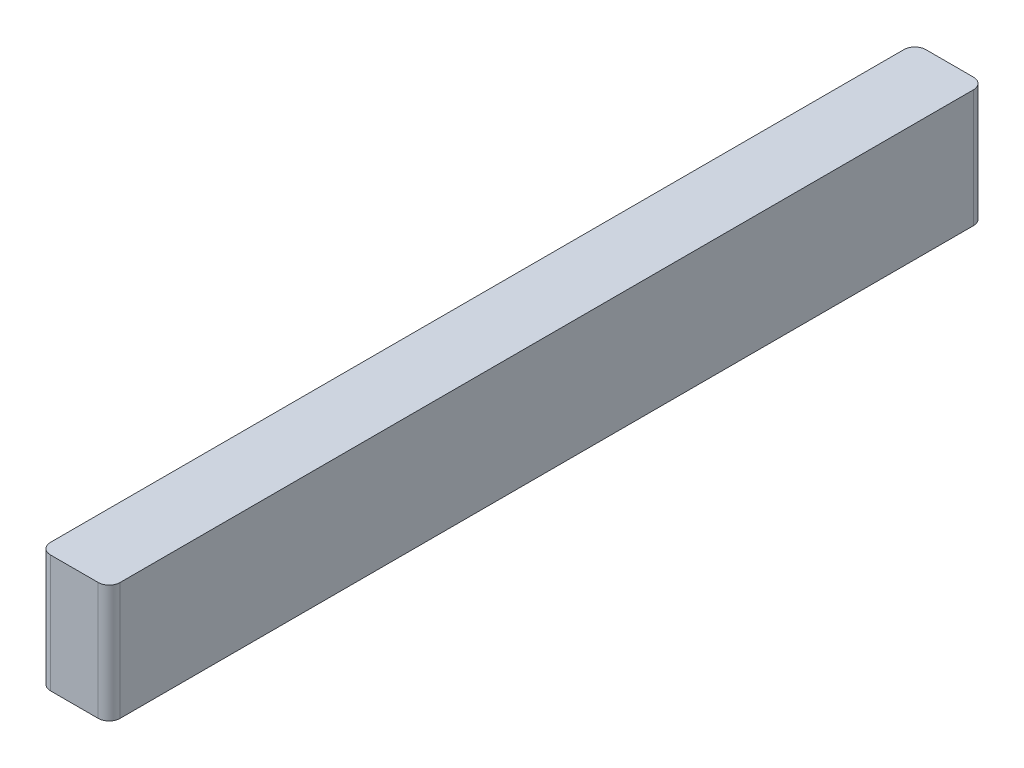
ISO-10303-21;
HEADER;
FILE_DESCRIPTION(('STEP AP214'),'2;1');
FILE_NAME('part.step','',(''),(''),'','','');
FILE_SCHEMA(('AUTOMOTIVE_DESIGN { 1 0 10303 214 1 1 1 1 }'));
ENDSEC;
DATA;
#1=APPLICATION_CONTEXT('core data for automotive mechanical design processes');
#2=APPLICATION_PROTOCOL_DEFINITION('international standard','automotive_design',2000,#1);
#3=PRODUCT_CONTEXT('',#1,'mechanical');
#4=PRODUCT('Part','Part','',(#3));
#5=PRODUCT_RELATED_PRODUCT_CATEGORY('part','',(#4));
#6=PRODUCT_DEFINITION_FORMATION('','',#4);
#7=PRODUCT_DEFINITION_CONTEXT('part definition',#1,'design');
#8=PRODUCT_DEFINITION('design','',#6,#7);
#9=PRODUCT_DEFINITION_SHAPE('','',#8);
#10=(LENGTH_UNIT() NAMED_UNIT(*) SI_UNIT(.MILLI.,.METRE.));
#11=(NAMED_UNIT(*) PLANE_ANGLE_UNIT() SI_UNIT($,.RADIAN.));
#12=(NAMED_UNIT(*) SI_UNIT($,.STERADIAN.) SOLID_ANGLE_UNIT());
#13=UNCERTAINTY_MEASURE_WITH_UNIT(LENGTH_MEASURE(1.E-05),#10,'distance_accuracy_value','');
#14=(GEOMETRIC_REPRESENTATION_CONTEXT(3) GLOBAL_UNCERTAINTY_ASSIGNED_CONTEXT((#13)) GLOBAL_UNIT_ASSIGNED_CONTEXT((#10,
#11,#12)) REPRESENTATION_CONTEXT('',''));
#15=CARTESIAN_POINT('',(0.,0.,0.));
#16=DIRECTION('',(0.,0.,1.));
#17=DIRECTION('',(1.,0.,0.));
#18=AXIS2_PLACEMENT_3D('',#15,#16,#17);
#19=CARTESIAN_POINT('',(34.036,68.326,-6.35));
#20=DIRECTION('',(0.,-1.,0.));
#21=DIRECTION('',(0.,0.,-1.));
#22=AXIS2_PLACEMENT_3D('',#19,#20,#21);
#23=CYLINDRICAL_SURFACE('',#22,6.35);
#24=CARTESIAN_POINT('',(34.036,0.,-6.35));
#25=DIRECTION('',(0.,1.,0.));
#26=DIRECTION('',(0.,0.,1.));
#27=AXIS2_PLACEMENT_3D('',#24,#25,#26);
#28=CIRCLE('',#27,6.35);
#29=CARTESIAN_POINT('',(34.036,0.,0.));
#30=VERTEX_POINT('',#29);
#31=CARTESIAN_POINT('',(40.386,0.,-6.35000000000004));
#32=VERTEX_POINT('',#31);
#33=EDGE_CURVE('E131',#30,#32,#28,.T.);
#34=ORIENTED_EDGE('',*,*,#33,.T.);
#35=DIRECTION('',(0.,-1.,0.));
#36=VECTOR('',#35,1.);
#37=CARTESIAN_POINT('',(40.386,68.326,-6.35000000000004));
#38=LINE('',#37,#36);
#39=CARTESIAN_POINT('',(40.386,68.326,-6.35000000000004));
#40=VERTEX_POINT('',#39);
#41=EDGE_CURVE('E11',#40,#32,#38,.T.);
#42=ORIENTED_EDGE('',*,*,#41,.F.);
#43=CARTESIAN_POINT('',(34.036,68.326,-6.35));
#44=DIRECTION('',(0.,1.,0.));
#45=DIRECTION('',(0.,0.,1.));
#46=AXIS2_PLACEMENT_3D('',#43,#44,#45);
#47=CIRCLE('',#46,6.35);
#48=CARTESIAN_POINT('',(34.036,68.326,0.));
#49=VERTEX_POINT('',#48);
#50=EDGE_CURVE('E145',#49,#40,#47,.T.);
#51=ORIENTED_EDGE('',*,*,#50,.F.);
#52=DIRECTION('',(0.,-1.,0.));
#53=VECTOR('',#52,1.);
#54=CARTESIAN_POINT('',(34.036,68.326,0.));
#55=LINE('',#54,#53);
#56=EDGE_CURVE('E127',#49,#30,#55,.T.);
#57=ORIENTED_EDGE('',*,*,#56,.T.);
#58=EDGE_LOOP('',(#34,#42,#51,#57));
#59=FACE_BOUND('',#58,.T.);
#60=ADVANCED_FACE('F35',(#59),#23,.T.);
#61=CARTESIAN_POINT('',(40.386,68.326,-6.35000000000004));
#62=DIRECTION('',(-1.,0.,0.));
#63=DIRECTION('',(0.,0.,1.));
#64=AXIS2_PLACEMENT_3D('',#61,#62,#63);
#65=PLANE('',#64);
#66=DIRECTION('',(0.,0.,-1.));
#67=VECTOR('',#66,1.);
#68=CARTESIAN_POINT('',(40.386,0.,-6.35000000000004));
#69=LINE('',#68,#67);
#70=CARTESIAN_POINT('',(40.386,0.,-501.65));
#71=VERTEX_POINT('',#70);
#72=EDGE_CURVE('E134',#32,#71,#69,.T.);
#73=ORIENTED_EDGE('',*,*,#72,.T.);
#74=DIRECTION('',(0.,-1.,0.));
#75=VECTOR('',#74,1.);
#76=CARTESIAN_POINT('',(40.386,68.326,-501.65));
#77=LINE('',#76,#75);
#78=CARTESIAN_POINT('',(40.386,68.326,-501.65));
#79=VERTEX_POINT('',#78);
#80=EDGE_CURVE('E43',#79,#71,#77,.T.);
#81=ORIENTED_EDGE('',*,*,#80,.F.);
#82=DIRECTION('',(0.,0.,-1.));
#83=VECTOR('',#82,1.);
#84=CARTESIAN_POINT('',(40.386,68.326,-6.35000000000004));
#85=LINE('',#84,#83);
#86=EDGE_CURVE('E94',#40,#79,#85,.T.);
#87=ORIENTED_EDGE('',*,*,#86,.F.);
#88=ORIENTED_EDGE('',*,*,#41,.T.);
#89=EDGE_LOOP('',(#73,#81,#87,#88));
#90=FACE_BOUND('',#89,.T.);
#91=ADVANCED_FACE('F180',(#90),#65,.F.);
#92=CARTESIAN_POINT('',(34.036,68.326,-501.65));
#93=DIRECTION('',(0.,-1.,0.));
#94=DIRECTION('',(0.,0.,-1.));
#95=AXIS2_PLACEMENT_3D('',#92,#93,#94);
#96=CYLINDRICAL_SURFACE('',#95,6.34999999999998);
#97=CARTESIAN_POINT('',(34.036,0.,-501.65));
#98=DIRECTION('',(0.,1.,0.));
#99=DIRECTION('',(0.,0.,-1.));
#100=AXIS2_PLACEMENT_3D('',#97,#98,#99);
#101=CIRCLE('',#100,6.34999999999998);
#102=CARTESIAN_POINT('',(34.036,0.,-508.));
#103=VERTEX_POINT('',#102);
#104=EDGE_CURVE('E136',#71,#103,#101,.T.);
#105=ORIENTED_EDGE('',*,*,#104,.T.);
#106=DIRECTION('',(0.,-1.,0.));
#107=VECTOR('',#106,1.);
#108=CARTESIAN_POINT('',(34.036,68.326,-508.));
#109=LINE('',#108,#107);
#110=CARTESIAN_POINT('',(34.036,68.326,-508.));
#111=VERTEX_POINT('',#110);
#112=EDGE_CURVE('E152',#111,#103,#109,.T.);
#113=ORIENTED_EDGE('',*,*,#112,.F.);
#114=CARTESIAN_POINT('',(34.036,68.326,-501.65));
#115=DIRECTION('',(0.,1.,0.));
#116=DIRECTION('',(0.,0.,-1.));
#117=AXIS2_PLACEMENT_3D('',#114,#115,#116);
#118=CIRCLE('',#117,6.34999999999998);
#119=EDGE_CURVE('E160',#79,#111,#118,.T.);
#120=ORIENTED_EDGE('',*,*,#119,.F.);
#121=ORIENTED_EDGE('',*,*,#80,.T.);
#122=EDGE_LOOP('',(#105,#113,#120,#121));
#123=FACE_BOUND('',#122,.T.);
#124=ADVANCED_FACE('F158',(#123),#96,.T.);
#125=CARTESIAN_POINT('',(6.35000000000004,68.326,-508.));
#126=DIRECTION('',(0.,0.,1.));
#127=DIRECTION('',(1.,0.,0.));
#128=AXIS2_PLACEMENT_3D('',#125,#126,#127);
#129=PLANE('',#128);
#130=DIRECTION('',(-1.,0.,0.));
#131=VECTOR('',#130,1.);
#132=CARTESIAN_POINT('',(6.35000000000004,0.,-508.));
#133=LINE('',#132,#131);
#134=CARTESIAN_POINT('',(6.35000000000004,0.,-508.));
#135=VERTEX_POINT('',#134);
#136=EDGE_CURVE('E138',#103,#135,#133,.T.);
#137=ORIENTED_EDGE('',*,*,#136,.T.);
#138=DIRECTION('',(0.,-1.,0.));
#139=VECTOR('',#138,1.);
#140=CARTESIAN_POINT('',(6.35000000000004,68.326,-508.));
#141=LINE('',#140,#139);
#142=CARTESIAN_POINT('',(6.35000000000004,68.326,-508.));
#143=VERTEX_POINT('',#142);
#144=EDGE_CURVE('E149',#143,#135,#141,.T.);
#145=ORIENTED_EDGE('',*,*,#144,.F.);
#146=DIRECTION('',(-1.,0.,0.));
#147=VECTOR('',#146,1.);
#148=CARTESIAN_POINT('',(6.35000000000004,68.326,-508.));
#149=LINE('',#148,#147);
#150=EDGE_CURVE('E172',#111,#143,#149,.T.);
#151=ORIENTED_EDGE('',*,*,#150,.F.);
#152=ORIENTED_EDGE('',*,*,#112,.T.);
#153=EDGE_LOOP('',(#137,#145,#151,#152));
#154=FACE_BOUND('',#153,.T.);
#155=ADVANCED_FACE('F168',(#154),#129,.F.);
#156=CARTESIAN_POINT('',(6.35,68.326,-501.65));
#157=DIRECTION('',(0.,-1.,0.));
#158=DIRECTION('',(0.,0.,-1.));
#159=AXIS2_PLACEMENT_3D('',#156,#157,#158);
#160=CYLINDRICAL_SURFACE('',#159,6.34999999999998);
#161=CARTESIAN_POINT('',(6.35,0.,-501.65));
#162=DIRECTION('',(0.,1.,0.));
#163=DIRECTION('',(0.,0.,-1.));
#164=AXIS2_PLACEMENT_3D('',#161,#162,#163);
#165=CIRCLE('',#164,6.34999999999998);
#166=CARTESIAN_POINT('',(0.,0.,-501.65));
#167=VERTEX_POINT('',#166);
#168=EDGE_CURVE('E140',#135,#167,#165,.T.);
#169=ORIENTED_EDGE('',*,*,#168,.T.);
#170=DIRECTION('',(0.,-1.,0.));
#171=VECTOR('',#170,1.);
#172=CARTESIAN_POINT('',(0.,68.326,-501.65));
#173=LINE('',#172,#171);
#174=CARTESIAN_POINT('',(0.,68.326,-501.65));
#175=VERTEX_POINT('',#174);
#176=EDGE_CURVE('E122',#175,#167,#173,.T.);
#177=ORIENTED_EDGE('',*,*,#176,.F.);
#178=CARTESIAN_POINT('',(6.35,68.326,-501.65));
#179=DIRECTION('',(0.,1.,0.));
#180=DIRECTION('',(0.,0.,-1.));
#181=AXIS2_PLACEMENT_3D('',#178,#179,#180);
#182=CIRCLE('',#181,6.34999999999998);
#183=EDGE_CURVE('E113',#143,#175,#182,.T.);
#184=ORIENTED_EDGE('',*,*,#183,.F.);
#185=ORIENTED_EDGE('',*,*,#144,.T.);
#186=EDGE_LOOP('',(#169,#177,#184,#185));
#187=FACE_BOUND('',#186,.T.);
#188=ADVANCED_FACE('F171',(#187),#160,.T.);
#189=CARTESIAN_POINT('',(0.,68.326,-6.35000000000004));
#190=DIRECTION('',(1.,0.,0.));
#191=DIRECTION('',(0.,0.,-1.));
#192=AXIS2_PLACEMENT_3D('',#189,#190,#191);
#193=PLANE('',#192);
#194=DIRECTION('',(0.,0.,1.));
#195=VECTOR('',#194,1.);
#196=CARTESIAN_POINT('',(0.,0.,-6.35000000000004));
#197=LINE('',#196,#195);
#198=CARTESIAN_POINT('',(0.,0.,-6.35000000000004));
#199=VERTEX_POINT('',#198);
#200=EDGE_CURVE('E121',#167,#199,#197,.T.);
#201=ORIENTED_EDGE('',*,*,#200,.T.);
#202=DIRECTION('',(0.,-1.,0.));
#203=VECTOR('',#202,1.);
#204=CARTESIAN_POINT('',(0.,68.326,-6.35000000000004));
#205=LINE('',#204,#203);
#206=CARTESIAN_POINT('',(0.,68.326,-6.35000000000004));
#207=VERTEX_POINT('',#206);
#208=EDGE_CURVE('E118',#207,#199,#205,.T.);
#209=ORIENTED_EDGE('',*,*,#208,.F.);
#210=DIRECTION('',(0.,0.,1.));
#211=VECTOR('',#210,1.);
#212=CARTESIAN_POINT('',(0.,68.326,-6.35000000000004));
#213=LINE('',#212,#211);
#214=EDGE_CURVE('E107',#175,#207,#213,.T.);
#215=ORIENTED_EDGE('',*,*,#214,.F.);
#216=ORIENTED_EDGE('',*,*,#176,.T.);
#217=EDGE_LOOP('',(#201,#209,#215,#216));
#218=FACE_BOUND('',#217,.T.);
#219=ADVANCED_FACE('F119',(#218),#193,.F.);
#220=CARTESIAN_POINT('',(6.35,68.326,-6.35));
#221=DIRECTION('',(0.,-1.,0.));
#222=DIRECTION('',(0.,0.,-1.));
#223=AXIS2_PLACEMENT_3D('',#220,#221,#222);
#224=CYLINDRICAL_SURFACE('',#223,6.35);
#225=CARTESIAN_POINT('',(6.35,0.,-6.35));
#226=DIRECTION('',(0.,1.,0.));
#227=DIRECTION('',(0.,0.,-1.));
#228=AXIS2_PLACEMENT_3D('',#225,#226,#227);
#229=CIRCLE('',#228,6.35);
#230=CARTESIAN_POINT('',(6.35000000000004,0.,0.));
#231=VERTEX_POINT('',#230);
#232=EDGE_CURVE('E80',#199,#231,#229,.T.);
#233=ORIENTED_EDGE('',*,*,#232,.T.);
#234=DIRECTION('',(0.,-1.,0.));
#235=VECTOR('',#234,1.);
#236=CARTESIAN_POINT('',(6.35000000000004,68.326,0.));
#237=LINE('',#236,#235);
#238=CARTESIAN_POINT('',(6.35000000000004,68.326,0.));
#239=VERTEX_POINT('',#238);
#240=EDGE_CURVE('E123',#239,#231,#237,.T.);
#241=ORIENTED_EDGE('',*,*,#240,.F.);
#242=CARTESIAN_POINT('',(6.35,68.326,-6.35));
#243=DIRECTION('',(0.,1.,0.));
#244=DIRECTION('',(0.,0.,-1.));
#245=AXIS2_PLACEMENT_3D('',#242,#243,#244);
#246=CIRCLE('',#245,6.35);
#247=EDGE_CURVE('E111',#207,#239,#246,.T.);
#248=ORIENTED_EDGE('',*,*,#247,.F.);
#249=ORIENTED_EDGE('',*,*,#208,.T.);
#250=EDGE_LOOP('',(#233,#241,#248,#249));
#251=FACE_BOUND('',#250,.T.);
#252=ADVANCED_FACE('F125',(#251),#224,.T.);
#253=CARTESIAN_POINT('',(6.35000000000004,68.326,0.));
#254=DIRECTION('',(0.,0.,-1.));
#255=DIRECTION('',(-1.,0.,0.));
#256=AXIS2_PLACEMENT_3D('',#253,#254,#255);
#257=PLANE('',#256);
#258=DIRECTION('',(1.,0.,0.));
#259=VECTOR('',#258,1.);
#260=CARTESIAN_POINT('',(6.35000000000004,0.,0.));
#261=LINE('',#260,#259);
#262=EDGE_CURVE('E86',#231,#30,#261,.T.);
#263=ORIENTED_EDGE('',*,*,#262,.T.);
#264=ORIENTED_EDGE('',*,*,#56,.F.);
#265=DIRECTION('',(1.,0.,0.));
#266=VECTOR('',#265,1.);
#267=CARTESIAN_POINT('',(6.35000000000004,68.326,0.));
#268=LINE('',#267,#266);
#269=EDGE_CURVE('E51',#239,#49,#268,.T.);
#270=ORIENTED_EDGE('',*,*,#269,.F.);
#271=ORIENTED_EDGE('',*,*,#240,.T.);
#272=EDGE_LOOP('',(#263,#264,#270,#271));
#273=FACE_BOUND('',#272,.T.);
#274=ADVANCED_FACE('F196',(#273),#257,.F.);
#275=CARTESIAN_POINT('',(34.036,68.326,-6.35));
#276=DIRECTION('',(0.,1.,0.));
#277=DIRECTION('',(0.,0.,1.));
#278=AXIS2_PLACEMENT_3D('',#275,#276,#277);
#279=PLANE('',#278);
#280=ORIENTED_EDGE('',*,*,#50,.T.);
#281=ORIENTED_EDGE('',*,*,#86,.T.);
#282=ORIENTED_EDGE('',*,*,#119,.T.);
#283=ORIENTED_EDGE('',*,*,#150,.T.);
#284=ORIENTED_EDGE('',*,*,#183,.T.);
#285=ORIENTED_EDGE('',*,*,#214,.T.);
#286=ORIENTED_EDGE('',*,*,#247,.T.);
#287=ORIENTED_EDGE('',*,*,#269,.T.);
#288=EDGE_LOOP('',(#280,#281,#282,#283,#284,#285,#286,#287));
#289=FACE_BOUND('',#288,.T.);
#290=ADVANCED_FACE('F109',(#289),#279,.T.);
#291=CARTESIAN_POINT('',(34.036,0.,-6.35));
#292=DIRECTION('',(0.,1.,0.));
#293=DIRECTION('',(0.,0.,1.));
#294=AXIS2_PLACEMENT_3D('',#291,#292,#293);
#295=PLANE('',#294);
#296=ORIENTED_EDGE('',*,*,#33,.F.);
#297=ORIENTED_EDGE('',*,*,#262,.F.);
#298=ORIENTED_EDGE('',*,*,#232,.F.);
#299=ORIENTED_EDGE('',*,*,#200,.F.);
#300=ORIENTED_EDGE('',*,*,#168,.F.);
#301=ORIENTED_EDGE('',*,*,#136,.F.);
#302=ORIENTED_EDGE('',*,*,#104,.F.);
#303=ORIENTED_EDGE('',*,*,#72,.F.);
#304=EDGE_LOOP('',(#296,#297,#298,#299,#300,#301,#302,#303));
#305=FACE_BOUND('',#304,.T.);
#306=ADVANCED_FACE('F164',(#305),#295,.F.);
#307=CLOSED_SHELL('',(#60,#91,#124,#155,#188,#219,#252,#274,#290,#306));
#308=MANIFOLD_SOLID_BREP('B2',#307);
#309=ADVANCED_BREP_SHAPE_REPRESENTATION('',(#18,#308),#14);
#310=SHAPE_DEFINITION_REPRESENTATION(#9,#309);
ENDSEC;
END-ISO-10303-21;
